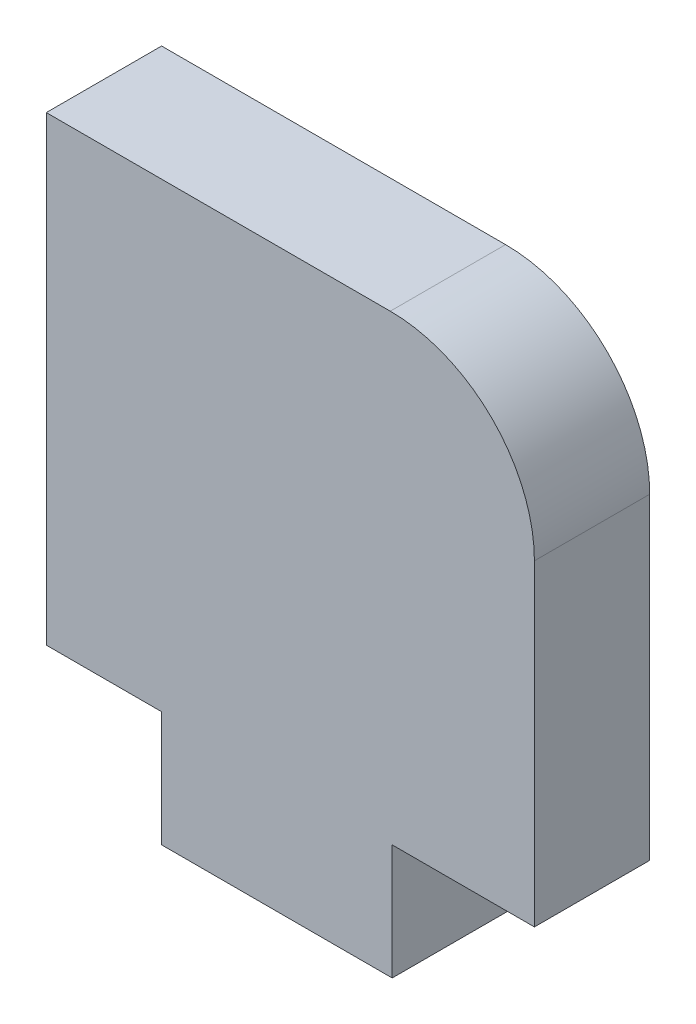
ISO-10303-21;
HEADER;
FILE_DESCRIPTION(('STEP AP214'),'2;1');
FILE_NAME('part.step','',(''),(''),'','','');
FILE_SCHEMA(('AUTOMOTIVE_DESIGN { 1 0 10303 214 1 1 1 1 }'));
ENDSEC;
DATA;
#1=APPLICATION_CONTEXT('core data for automotive mechanical design processes');
#2=APPLICATION_PROTOCOL_DEFINITION('international standard','automotive_design',2000,#1);
#3=PRODUCT_CONTEXT('',#1,'mechanical');
#4=PRODUCT('Part','Part','',(#3));
#5=PRODUCT_RELATED_PRODUCT_CATEGORY('part','',(#4));
#6=PRODUCT_DEFINITION_FORMATION('','',#4);
#7=PRODUCT_DEFINITION_CONTEXT('part definition',#1,'design');
#8=PRODUCT_DEFINITION('design','',#6,#7);
#9=PRODUCT_DEFINITION_SHAPE('','',#8);
#10=(LENGTH_UNIT() NAMED_UNIT(*) SI_UNIT(.MILLI.,.METRE.));
#11=(NAMED_UNIT(*) PLANE_ANGLE_UNIT() SI_UNIT($,.RADIAN.));
#12=(NAMED_UNIT(*) SI_UNIT($,.STERADIAN.) SOLID_ANGLE_UNIT());
#13=UNCERTAINTY_MEASURE_WITH_UNIT(LENGTH_MEASURE(1.E-05),#10,'distance_accuracy_value','');
#14=(GEOMETRIC_REPRESENTATION_CONTEXT(3) GLOBAL_UNCERTAINTY_ASSIGNED_CONTEXT((#13)) GLOBAL_UNIT_ASSIGNED_CONTEXT((#10,
#11,#12)) REPRESENTATION_CONTEXT('',''));
#15=CARTESIAN_POINT('',(0.,0.,0.));
#16=DIRECTION('',(0.,0.,1.));
#17=DIRECTION('',(1.,0.,0.));
#18=AXIS2_PLACEMENT_3D('',#15,#16,#17);
#19=CARTESIAN_POINT('',(-5.924316659739,-11.,4.));
#20=DIRECTION('',(1.,0.,0.));
#21=DIRECTION('',(0.,0.,-1.));
#22=AXIS2_PLACEMENT_3D('',#19,#20,#21);
#23=PLANE('',#22);
#24=DIRECTION('',(0.,-1.,0.));
#25=VECTOR('',#24,1.);
#26=CARTESIAN_POINT('',(-5.924316659739,-11.,0.));
#27=LINE('',#26,#25);
#28=CARTESIAN_POINT('',(-5.924316659739,5.,0.));
#29=VERTEX_POINT('',#28);
#30=CARTESIAN_POINT('',(-5.924316659739,-11.,0.));
#31=VERTEX_POINT('',#30);
#32=EDGE_CURVE('E134',#29,#31,#27,.T.);
#33=ORIENTED_EDGE('',*,*,#32,.T.);
#34=DIRECTION('',(0.,0.,-1.));
#35=VECTOR('',#34,1.);
#36=CARTESIAN_POINT('',(-5.924316659739,-11.,4.));
#37=LINE('',#36,#35);
#38=CARTESIAN_POINT('',(-5.924316659739,-11.,4.));
#39=VERTEX_POINT('',#38);
#40=EDGE_CURVE('E11',#39,#31,#37,.T.);
#41=ORIENTED_EDGE('',*,*,#40,.F.);
#42=DIRECTION('',(0.,-1.,0.));
#43=VECTOR('',#42,1.);
#44=CARTESIAN_POINT('',(-5.924316659739,-11.,4.));
#45=LINE('',#44,#43);
#46=CARTESIAN_POINT('',(-5.924316659739,5.,4.));
#47=VERTEX_POINT('',#46);
#48=EDGE_CURVE('E150',#47,#39,#45,.T.);
#49=ORIENTED_EDGE('',*,*,#48,.F.);
#50=DIRECTION('',(0.,0.,-1.));
#51=VECTOR('',#50,1.);
#52=CARTESIAN_POINT('',(-5.924316659739,5.,4.));
#53=LINE('',#52,#51);
#54=EDGE_CURVE('E130',#47,#29,#53,.T.);
#55=ORIENTED_EDGE('',*,*,#54,.T.);
#56=EDGE_LOOP('',(#33,#41,#49,#55));
#57=FACE_BOUND('',#56,.T.);
#58=ADVANCED_FACE('F32',(#57),#23,.F.);
#59=CARTESIAN_POINT('',(-1.924316659739,-11.,4.));
#60=DIRECTION('',(0.,1.,0.));
#61=DIRECTION('',(0.,0.,1.));
#62=AXIS2_PLACEMENT_3D('',#59,#60,#61);
#63=PLANE('',#62);
#64=DIRECTION('',(1.,0.,0.));
#65=VECTOR('',#64,1.);
#66=CARTESIAN_POINT('',(-1.924316659739,-11.,0.));
#67=LINE('',#66,#65);
#68=CARTESIAN_POINT('',(-1.924316659739,-11.,0.));
#69=VERTEX_POINT('',#68);
#70=EDGE_CURVE('E137',#31,#69,#67,.T.);
#71=ORIENTED_EDGE('',*,*,#70,.T.);
#72=DIRECTION('',(0.,0.,-1.));
#73=VECTOR('',#72,1.);
#74=CARTESIAN_POINT('',(-1.924316659739,-11.,4.));
#75=LINE('',#74,#73);
#76=CARTESIAN_POINT('',(-1.924316659739,-11.,4.));
#77=VERTEX_POINT('',#76);
#78=EDGE_CURVE('E40',#77,#69,#75,.T.);
#79=ORIENTED_EDGE('',*,*,#78,.F.);
#80=DIRECTION('',(1.,0.,0.));
#81=VECTOR('',#80,1.);
#82=CARTESIAN_POINT('',(-1.924316659739,-11.,4.));
#83=LINE('',#82,#81);
#84=EDGE_CURVE('E94',#39,#77,#83,.T.);
#85=ORIENTED_EDGE('',*,*,#84,.F.);
#86=ORIENTED_EDGE('',*,*,#40,.T.);
#87=EDGE_LOOP('',(#71,#79,#85,#86));
#88=FACE_BOUND('',#87,.T.);
#89=ADVANCED_FACE('F193',(#88),#63,.F.);
#90=CARTESIAN_POINT('',(-1.924316659739,-15.,4.));
#91=DIRECTION('',(1.,0.,0.));
#92=DIRECTION('',(0.,0.,-1.));
#93=AXIS2_PLACEMENT_3D('',#90,#91,#92);
#94=PLANE('',#93);
#95=DIRECTION('',(0.,-1.,0.));
#96=VECTOR('',#95,1.);
#97=CARTESIAN_POINT('',(-1.924316659739,-15.,0.));
#98=LINE('',#97,#96);
#99=CARTESIAN_POINT('',(-1.924316659739,-15.,0.));
#100=VERTEX_POINT('',#99);
#101=EDGE_CURVE('E139',#69,#100,#98,.T.);
#102=ORIENTED_EDGE('',*,*,#101,.T.);
#103=DIRECTION('',(0.,0.,-1.));
#104=VECTOR('',#103,1.);
#105=CARTESIAN_POINT('',(-1.924316659739,-15.,4.));
#106=LINE('',#105,#104);
#107=CARTESIAN_POINT('',(-1.924316659739,-15.,4.));
#108=VERTEX_POINT('',#107);
#109=EDGE_CURVE('E160',#108,#100,#106,.T.);
#110=ORIENTED_EDGE('',*,*,#109,.F.);
#111=DIRECTION('',(0.,-1.,0.));
#112=VECTOR('',#111,1.);
#113=CARTESIAN_POINT('',(-1.924316659739,-15.,4.));
#114=LINE('',#113,#112);
#115=EDGE_CURVE('E168',#77,#108,#114,.T.);
#116=ORIENTED_EDGE('',*,*,#115,.F.);
#117=ORIENTED_EDGE('',*,*,#78,.T.);
#118=EDGE_LOOP('',(#102,#110,#116,#117));
#119=FACE_BOUND('',#118,.T.);
#120=ADVANCED_FACE('F166',(#119),#94,.F.);
#121=CARTESIAN_POINT('',(6.075683340261,-15.,4.));
#122=DIRECTION('',(0.,1.,0.));
#123=DIRECTION('',(0.,0.,1.));
#124=AXIS2_PLACEMENT_3D('',#121,#122,#123);
#125=PLANE('',#124);
#126=DIRECTION('',(1.,0.,0.));
#127=VECTOR('',#126,1.);
#128=CARTESIAN_POINT('',(6.075683340261,-15.,0.));
#129=LINE('',#128,#127);
#130=CARTESIAN_POINT('',(6.075683340261,-15.,0.));
#131=VERTEX_POINT('',#130);
#132=EDGE_CURVE('E141',#100,#131,#129,.T.);
#133=ORIENTED_EDGE('',*,*,#132,.T.);
#134=DIRECTION('',(0.,0.,-1.));
#135=VECTOR('',#134,1.);
#136=CARTESIAN_POINT('',(6.075683340261,-15.,4.));
#137=LINE('',#136,#135);
#138=CARTESIAN_POINT('',(6.075683340261,-15.,4.));
#139=VERTEX_POINT('',#138);
#140=EDGE_CURVE('E157',#139,#131,#137,.T.);
#141=ORIENTED_EDGE('',*,*,#140,.F.);
#142=DIRECTION('',(1.,0.,0.));
#143=VECTOR('',#142,1.);
#144=CARTESIAN_POINT('',(6.075683340261,-15.,4.));
#145=LINE('',#144,#143);
#146=EDGE_CURVE('E184',#108,#139,#145,.T.);
#147=ORIENTED_EDGE('',*,*,#146,.F.);
#148=ORIENTED_EDGE('',*,*,#109,.T.);
#149=EDGE_LOOP('',(#133,#141,#147,#148));
#150=FACE_BOUND('',#149,.T.);
#151=ADVANCED_FACE('F177',(#150),#125,.F.);
#152=CARTESIAN_POINT('',(6.075683340261,-11.,4.));
#153=DIRECTION('',(-1.,0.,0.));
#154=DIRECTION('',(0.,0.,1.));
#155=AXIS2_PLACEMENT_3D('',#152,#153,#154);
#156=PLANE('',#155);
#157=DIRECTION('',(0.,1.,0.));
#158=VECTOR('',#157,1.);
#159=CARTESIAN_POINT('',(6.075683340261,-11.,0.));
#160=LINE('',#159,#158);
#161=CARTESIAN_POINT('',(6.075683340261,-11.,0.));
#162=VERTEX_POINT('',#161);
#163=EDGE_CURVE('E143',#131,#162,#160,.T.);
#164=ORIENTED_EDGE('',*,*,#163,.T.);
#165=DIRECTION('',(0.,0.,-1.));
#166=VECTOR('',#165,1.);
#167=CARTESIAN_POINT('',(6.075683340261,-11.,4.));
#168=LINE('',#167,#166);
#169=CARTESIAN_POINT('',(6.075683340261,-11.,4.));
#170=VERTEX_POINT('',#169);
#171=EDGE_CURVE('E154',#170,#162,#168,.T.);
#172=ORIENTED_EDGE('',*,*,#171,.F.);
#173=DIRECTION('',(0.,1.,0.));
#174=VECTOR('',#173,1.);
#175=CARTESIAN_POINT('',(6.075683340261,-11.,4.));
#176=LINE('',#175,#174);
#177=EDGE_CURVE('E183',#139,#170,#176,.T.);
#178=ORIENTED_EDGE('',*,*,#177,.F.);
#179=ORIENTED_EDGE('',*,*,#140,.T.);
#180=EDGE_LOOP('',(#164,#172,#178,#179));
#181=FACE_BOUND('',#180,.T.);
#182=ADVANCED_FACE('F181',(#181),#156,.F.);
#183=CARTESIAN_POINT('',(6.075683340261,-11.,4.));
#184=DIRECTION('',(0.,1.,0.));
#185=DIRECTION('',(0.,0.,1.));
#186=AXIS2_PLACEMENT_3D('',#183,#184,#185);
#187=PLANE('',#186);
#188=DIRECTION('',(1.,0.,0.));
#189=VECTOR('',#188,1.);
#190=CARTESIAN_POINT('',(6.075683340261,-11.,0.));
#191=LINE('',#190,#189);
#192=CARTESIAN_POINT('',(11.0088575449908,-11.,0.));
#193=VERTEX_POINT('',#192);
#194=EDGE_CURVE('E145',#162,#193,#191,.T.);
#195=ORIENTED_EDGE('',*,*,#194,.T.);
#196=DIRECTION('',(0.,0.,-1.));
#197=VECTOR('',#196,1.);
#198=CARTESIAN_POINT('',(11.0088575449908,-11.,4.));
#199=LINE('',#198,#197);
#200=CARTESIAN_POINT('',(11.0088575449908,-11.,4.));
#201=VERTEX_POINT('',#200);
#202=EDGE_CURVE('E125',#201,#193,#199,.T.);
#203=ORIENTED_EDGE('',*,*,#202,.F.);
#204=DIRECTION('',(1.,0.,0.));
#205=VECTOR('',#204,1.);
#206=CARTESIAN_POINT('',(6.075683340261,-11.,4.));
#207=LINE('',#206,#205);
#208=EDGE_CURVE('E116',#170,#201,#207,.T.);
#209=ORIENTED_EDGE('',*,*,#208,.F.);
#210=ORIENTED_EDGE('',*,*,#171,.T.);
#211=EDGE_LOOP('',(#195,#203,#209,#210));
#212=FACE_BOUND('',#211,.T.);
#213=ADVANCED_FACE('F205',(#212),#187,.F.);
#214=CARTESIAN_POINT('',(11.0088575449908,0.,4.));
#215=DIRECTION('',(-1.,0.,0.));
#216=DIRECTION('',(0.,-1.,0.));
#217=AXIS2_PLACEMENT_3D('',#214,#215,#216);
#218=PLANE('',#217);
#219=DIRECTION('',(0.,1.,0.));
#220=VECTOR('',#219,1.);
#221=CARTESIAN_POINT('',(11.0088575449908,0.,0.));
#222=LINE('',#221,#220);
#223=CARTESIAN_POINT('',(11.0088575449908,0.,0.));
#224=VERTEX_POINT('',#223);
#225=EDGE_CURVE('E124',#193,#224,#222,.T.);
#226=ORIENTED_EDGE('',*,*,#225,.T.);
#227=DIRECTION('',(0.,0.,-1.));
#228=VECTOR('',#227,1.);
#229=CARTESIAN_POINT('',(11.0088575449908,0.,4.));
#230=LINE('',#229,#228);
#231=CARTESIAN_POINT('',(11.0088575449908,0.,4.));
#232=VERTEX_POINT('',#231);
#233=EDGE_CURVE('E121',#232,#224,#230,.T.);
#234=ORIENTED_EDGE('',*,*,#233,.F.);
#235=DIRECTION('',(0.,1.,0.));
#236=VECTOR('',#235,1.);
#237=CARTESIAN_POINT('',(11.0088575449908,0.,4.));
#238=LINE('',#237,#236);
#239=EDGE_CURVE('E110',#201,#232,#238,.T.);
#240=ORIENTED_EDGE('',*,*,#239,.F.);
#241=ORIENTED_EDGE('',*,*,#202,.T.);
#242=EDGE_LOOP('',(#226,#234,#240,#241));
#243=FACE_BOUND('',#242,.T.);
#244=ADVANCED_FACE('F122',(#243),#218,.F.);
#245=CARTESIAN_POINT('',(6.00885754499076,0.,4.));
#246=DIRECTION('',(0.,0.,-1.));
#247=DIRECTION('',(-1.,0.,0.));
#248=AXIS2_PLACEMENT_3D('',#245,#246,#247);
#249=CYLINDRICAL_SURFACE('',#248,5.);
#250=CARTESIAN_POINT('',(6.00885754499076,0.,0.));
#251=DIRECTION('',(0.,0.,1.));
#252=DIRECTION('',(1.,0.,0.));
#253=AXIS2_PLACEMENT_3D('',#250,#251,#252);
#254=CIRCLE('',#253,5.);
#255=CARTESIAN_POINT('',(6.00885754499076,5.,0.));
#256=VERTEX_POINT('',#255);
#257=EDGE_CURVE('E80',#224,#256,#254,.T.);
#258=ORIENTED_EDGE('',*,*,#257,.T.);
#259=DIRECTION('',(0.,0.,-1.));
#260=VECTOR('',#259,1.);
#261=CARTESIAN_POINT('',(6.00885754499076,5.,4.));
#262=LINE('',#261,#260);
#263=CARTESIAN_POINT('',(6.00885754499076,5.,4.));
#264=VERTEX_POINT('',#263);
#265=EDGE_CURVE('E126',#264,#256,#262,.T.);
#266=ORIENTED_EDGE('',*,*,#265,.F.);
#267=CARTESIAN_POINT('',(6.00885754499076,0.,4.));
#268=DIRECTION('',(0.,0.,1.));
#269=DIRECTION('',(1.,0.,0.));
#270=AXIS2_PLACEMENT_3D('',#267,#268,#269);
#271=CIRCLE('',#270,5.);
#272=EDGE_CURVE('E114',#232,#264,#271,.T.);
#273=ORIENTED_EDGE('',*,*,#272,.F.);
#274=ORIENTED_EDGE('',*,*,#233,.T.);
#275=EDGE_LOOP('',(#258,#266,#273,#274));
#276=FACE_BOUND('',#275,.T.);
#277=ADVANCED_FACE('F128',(#276),#249,.T.);
#278=CARTESIAN_POINT('',(-5.924316659739,5.,4.));
#279=DIRECTION('',(0.,-1.,0.));
#280=DIRECTION('',(1.,0.,0.));
#281=AXIS2_PLACEMENT_3D('',#278,#279,#280);
#282=PLANE('',#281);
#283=DIRECTION('',(-1.,0.,0.));
#284=VECTOR('',#283,1.);
#285=CARTESIAN_POINT('',(-5.924316659739,5.,0.));
#286=LINE('',#285,#284);
#287=EDGE_CURVE('E86',#256,#29,#286,.T.);
#288=ORIENTED_EDGE('',*,*,#287,.T.);
#289=ORIENTED_EDGE('',*,*,#54,.F.);
#290=DIRECTION('',(-1.,0.,0.));
#291=VECTOR('',#290,1.);
#292=CARTESIAN_POINT('',(-5.924316659739,5.,4.));
#293=LINE('',#292,#291);
#294=EDGE_CURVE('E48',#264,#47,#293,.T.);
#295=ORIENTED_EDGE('',*,*,#294,.F.);
#296=ORIENTED_EDGE('',*,*,#265,.T.);
#297=EDGE_LOOP('',(#288,#289,#295,#296));
#298=FACE_BOUND('',#297,.T.);
#299=ADVANCED_FACE('F213',(#298),#282,.F.);
#300=CARTESIAN_POINT('',(6.00885754499076,0.,4.));
#301=DIRECTION('',(0.,0.,1.));
#302=DIRECTION('',(1.,0.,0.));
#303=AXIS2_PLACEMENT_3D('',#300,#301,#302);
#304=PLANE('',#303);
#305=ORIENTED_EDGE('',*,*,#48,.T.);
#306=ORIENTED_EDGE('',*,*,#84,.T.);
#307=ORIENTED_EDGE('',*,*,#115,.T.);
#308=ORIENTED_EDGE('',*,*,#146,.T.);
#309=ORIENTED_EDGE('',*,*,#177,.T.);
#310=ORIENTED_EDGE('',*,*,#208,.T.);
#311=ORIENTED_EDGE('',*,*,#239,.T.);
#312=ORIENTED_EDGE('',*,*,#272,.T.);
#313=ORIENTED_EDGE('',*,*,#294,.T.);
#314=EDGE_LOOP('',(#305,#306,#307,#308,#309,#310,#311,#312,#313));
#315=FACE_BOUND('',#314,.T.);
#316=ADVANCED_FACE('F112',(#315),#304,.T.);
#317=CARTESIAN_POINT('',(6.00885754499076,0.,0.));
#318=DIRECTION('',(0.,0.,1.));
#319=DIRECTION('',(1.,0.,0.));
#320=AXIS2_PLACEMENT_3D('',#317,#318,#319);
#321=PLANE('',#320);
#322=ORIENTED_EDGE('',*,*,#32,.F.);
#323=ORIENTED_EDGE('',*,*,#287,.F.);
#324=ORIENTED_EDGE('',*,*,#257,.F.);
#325=ORIENTED_EDGE('',*,*,#225,.F.);
#326=ORIENTED_EDGE('',*,*,#194,.F.);
#327=ORIENTED_EDGE('',*,*,#163,.F.);
#328=ORIENTED_EDGE('',*,*,#132,.F.);
#329=ORIENTED_EDGE('',*,*,#101,.F.);
#330=ORIENTED_EDGE('',*,*,#70,.F.);
#331=EDGE_LOOP('',(#322,#323,#324,#325,#326,#327,#328,#329,#330));
#332=FACE_BOUND('',#331,.T.);
#333=ADVANCED_FACE('F172',(#332),#321,.F.);
#334=CLOSED_SHELL('',(#58,#89,#120,#151,#182,#213,#244,#277,#299,#316,#333));
#335=MANIFOLD_SOLID_BREP('B2',#334);
#336=ADVANCED_BREP_SHAPE_REPRESENTATION('',(#18,#335),#14);
#337=SHAPE_DEFINITION_REPRESENTATION(#9,#336);
ENDSEC;
END-ISO-10303-21;
